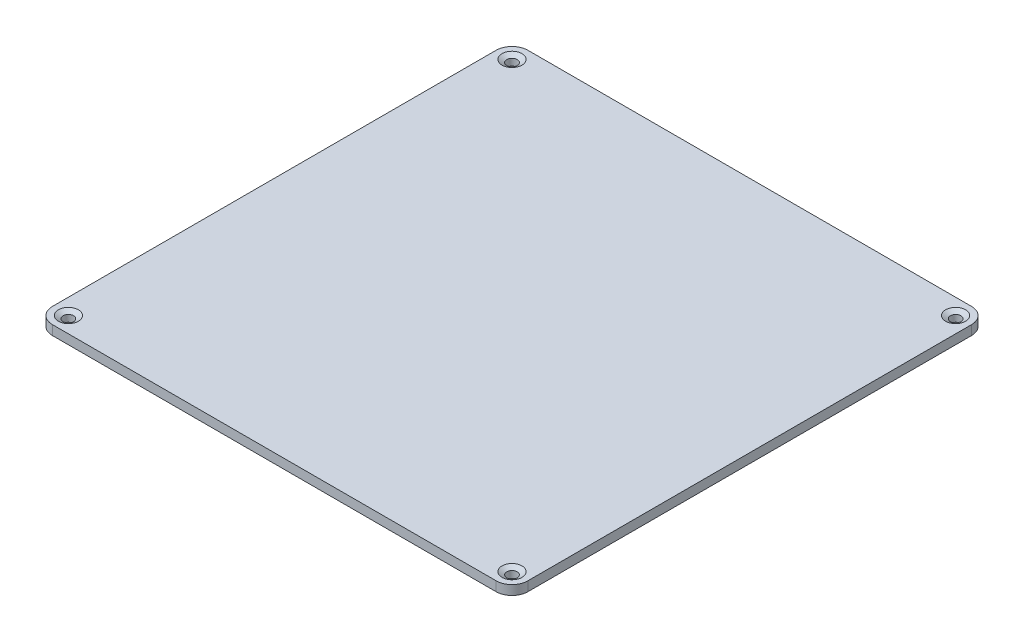
ISO-10303-21;
HEADER;
FILE_DESCRIPTION(('STEP AP214'),'2;1');
FILE_NAME('part.step','',(''),(''),'','','');
FILE_SCHEMA(('AUTOMOTIVE_DESIGN { 1 0 10303 214 1 1 1 1 }'));
ENDSEC;
DATA;
#1=APPLICATION_CONTEXT('core data for automotive mechanical design processes');
#2=APPLICATION_PROTOCOL_DEFINITION('international standard','automotive_design',2000,#1);
#3=PRODUCT_CONTEXT('',#1,'mechanical');
#4=PRODUCT('Part','Part','',(#3));
#5=PRODUCT_RELATED_PRODUCT_CATEGORY('part','',(#4));
#6=PRODUCT_DEFINITION_FORMATION('','',#4);
#7=PRODUCT_DEFINITION_CONTEXT('part definition',#1,'design');
#8=PRODUCT_DEFINITION('design','',#6,#7);
#9=PRODUCT_DEFINITION_SHAPE('','',#8);
#10=(LENGTH_UNIT() NAMED_UNIT(*) SI_UNIT(.MILLI.,.METRE.));
#11=(NAMED_UNIT(*) PLANE_ANGLE_UNIT() SI_UNIT($,.RADIAN.));
#12=(NAMED_UNIT(*) SI_UNIT($,.STERADIAN.) SOLID_ANGLE_UNIT());
#13=UNCERTAINTY_MEASURE_WITH_UNIT(LENGTH_MEASURE(1.E-05),#10,'distance_accuracy_value','');
#14=(GEOMETRIC_REPRESENTATION_CONTEXT(3) GLOBAL_UNCERTAINTY_ASSIGNED_CONTEXT((#13)) GLOBAL_UNIT_ASSIGNED_CONTEXT((#10,
#11,#12)) REPRESENTATION_CONTEXT('',''));
#15=CARTESIAN_POINT('',(0.,0.,0.));
#16=DIRECTION('',(0.,0.,1.));
#17=DIRECTION('',(1.,0.,0.));
#18=AXIS2_PLACEMENT_3D('',#15,#16,#17);
#19=CARTESIAN_POINT('',(75.,3.,75.));
#20=DIRECTION('',(-1.,0.,0.));
#21=DIRECTION('',(0.,0.,1.));
#22=AXIS2_PLACEMENT_3D('',#19,#20,#21);
#23=PLANE('',#22);
#24=DIRECTION('',(0.,0.,-1.));
#25=VECTOR('',#24,1.);
#26=CARTESIAN_POINT('',(75.,3.,75.));
#27=LINE('',#26,#25);
#28=CARTESIAN_POINT('',(75.,3.,70.));
#29=VERTEX_POINT('',#28);
#30=CARTESIAN_POINT('',(75.,3.,-70.));
#31=VERTEX_POINT('',#30);
#32=EDGE_CURVE('E127',#29,#31,#27,.T.);
#33=ORIENTED_EDGE('',*,*,#32,.F.);
#34=DIRECTION('',(0.,-1.,0.));
#35=VECTOR('',#34,1.);
#36=CARTESIAN_POINT('',(75.,3.,70.));
#37=LINE('',#36,#35);
#38=CARTESIAN_POINT('',(75.,0.,70.));
#39=VERTEX_POINT('',#38);
#40=EDGE_CURVE('E177',#29,#39,#37,.T.);
#41=ORIENTED_EDGE('',*,*,#40,.T.);
#42=DIRECTION('',(0.,0.,-1.));
#43=VECTOR('',#42,1.);
#44=CARTESIAN_POINT('',(75.,0.,75.));
#45=LINE('',#44,#43);
#46=CARTESIAN_POINT('',(75.,0.,-70.));
#47=VERTEX_POINT('',#46);
#48=EDGE_CURVE('E183',#39,#47,#45,.T.);
#49=ORIENTED_EDGE('',*,*,#48,.T.);
#50=DIRECTION('',(0.,-1.,0.));
#51=VECTOR('',#50,1.);
#52=CARTESIAN_POINT('',(75.,3.,-70.));
#53=LINE('',#52,#51);
#54=EDGE_CURVE('E175',#47,#31,#53,.F.);
#55=ORIENTED_EDGE('',*,*,#54,.T.);
#56=EDGE_LOOP('',(#33,#41,#49,#55));
#57=FACE_BOUND('',#56,.T.);
#58=ADVANCED_FACE('F35',(#57),#23,.F.);
#59=CARTESIAN_POINT('',(-75.,3.,-75.));
#60=DIRECTION('',(0.,0.,1.));
#61=DIRECTION('',(1.,0.,0.));
#62=AXIS2_PLACEMENT_3D('',#59,#60,#61);
#63=PLANE('',#62);
#64=DIRECTION('',(-1.,0.,0.));
#65=VECTOR('',#64,1.);
#66=CARTESIAN_POINT('',(-75.,3.,-75.));
#67=LINE('',#66,#65);
#68=CARTESIAN_POINT('',(70.,3.,-75.));
#69=VERTEX_POINT('',#68);
#70=CARTESIAN_POINT('',(-70.,3.,-75.));
#71=VERTEX_POINT('',#70);
#72=EDGE_CURVE('E130',#69,#71,#67,.T.);
#73=ORIENTED_EDGE('',*,*,#72,.F.);
#74=DIRECTION('',(0.,-1.,0.));
#75=VECTOR('',#74,1.);
#76=CARTESIAN_POINT('',(70.,3.,-75.));
#77=LINE('',#76,#75);
#78=CARTESIAN_POINT('',(70.,0.,-75.));
#79=VERTEX_POINT('',#78);
#80=EDGE_CURVE('E11',#69,#79,#77,.T.);
#81=ORIENTED_EDGE('',*,*,#80,.T.);
#82=DIRECTION('',(-1.,0.,0.));
#83=VECTOR('',#82,1.);
#84=CARTESIAN_POINT('',(-75.,0.,-75.));
#85=LINE('',#84,#83);
#86=CARTESIAN_POINT('',(-70.,0.,-75.));
#87=VERTEX_POINT('',#86);
#88=EDGE_CURVE('E132',#79,#87,#85,.T.);
#89=ORIENTED_EDGE('',*,*,#88,.T.);
#90=DIRECTION('',(0.,-1.,0.));
#91=VECTOR('',#90,1.);
#92=CARTESIAN_POINT('',(-70.,3.,-75.));
#93=LINE('',#92,#91);
#94=EDGE_CURVE('E43',#87,#71,#93,.F.);
#95=ORIENTED_EDGE('',*,*,#94,.T.);
#96=EDGE_LOOP('',(#73,#81,#89,#95));
#97=FACE_BOUND('',#96,.T.);
#98=ADVANCED_FACE('F226',(#97),#63,.F.);
#99=CARTESIAN_POINT('',(-75.,3.,75.));
#100=DIRECTION('',(1.,0.,0.));
#101=DIRECTION('',(0.,0.,-1.));
#102=AXIS2_PLACEMENT_3D('',#99,#100,#101);
#103=PLANE('',#102);
#104=DIRECTION('',(0.,0.,1.));
#105=VECTOR('',#104,1.);
#106=CARTESIAN_POINT('',(-75.,0.,75.));
#107=LINE('',#106,#105);
#108=CARTESIAN_POINT('',(-75.,0.,-70.));
#109=VERTEX_POINT('',#108);
#110=CARTESIAN_POINT('',(-75.,0.,70.));
#111=VERTEX_POINT('',#110);
#112=EDGE_CURVE('E128',#109,#111,#107,.T.);
#113=ORIENTED_EDGE('',*,*,#112,.T.);
#114=DIRECTION('',(0.,-1.,0.));
#115=VECTOR('',#114,1.);
#116=CARTESIAN_POINT('',(-75.,3.,70.));
#117=LINE('',#116,#115);
#118=CARTESIAN_POINT('',(-75.,3.,70.));
#119=VERTEX_POINT('',#118);
#120=EDGE_CURVE('E106',#111,#119,#117,.F.);
#121=ORIENTED_EDGE('',*,*,#120,.T.);
#122=DIRECTION('',(0.,0.,1.));
#123=VECTOR('',#122,1.);
#124=CARTESIAN_POINT('',(-75.,3.,75.));
#125=LINE('',#124,#123);
#126=CARTESIAN_POINT('',(-75.,3.,-70.));
#127=VERTEX_POINT('',#126);
#128=EDGE_CURVE('E195',#127,#119,#125,.T.);
#129=ORIENTED_EDGE('',*,*,#128,.F.);
#130=DIRECTION('',(0.,-1.,0.));
#131=VECTOR('',#130,1.);
#132=CARTESIAN_POINT('',(-75.,3.,-70.));
#133=LINE('',#132,#131);
#134=EDGE_CURVE('E111',#127,#109,#133,.T.);
#135=ORIENTED_EDGE('',*,*,#134,.T.);
#136=EDGE_LOOP('',(#113,#121,#129,#135));
#137=FACE_BOUND('',#136,.T.);
#138=ADVANCED_FACE('F231',(#137),#103,.F.);
#139=CARTESIAN_POINT('',(-75.,3.,75.));
#140=DIRECTION('',(0.,0.,-1.));
#141=DIRECTION('',(-1.,0.,0.));
#142=AXIS2_PLACEMENT_3D('',#139,#140,#141);
#143=PLANE('',#142);
#144=DIRECTION('',(1.,0.,0.));
#145=VECTOR('',#144,1.);
#146=CARTESIAN_POINT('',(-75.,3.,75.));
#147=LINE('',#146,#145);
#148=CARTESIAN_POINT('',(-70.,3.,75.));
#149=VERTEX_POINT('',#148);
#150=CARTESIAN_POINT('',(70.,3.,75.));
#151=VERTEX_POINT('',#150);
#152=EDGE_CURVE('E121',#149,#151,#147,.T.);
#153=ORIENTED_EDGE('',*,*,#152,.F.);
#154=DIRECTION('',(0.,-1.,0.));
#155=VECTOR('',#154,1.);
#156=CARTESIAN_POINT('',(-70.,3.,75.));
#157=LINE('',#156,#155);
#158=CARTESIAN_POINT('',(-70.,0.,75.));
#159=VERTEX_POINT('',#158);
#160=EDGE_CURVE('E105',#149,#159,#157,.T.);
#161=ORIENTED_EDGE('',*,*,#160,.T.);
#162=DIRECTION('',(1.,0.,0.));
#163=VECTOR('',#162,1.);
#164=CARTESIAN_POINT('',(-75.,0.,75.));
#165=LINE('',#164,#163);
#166=CARTESIAN_POINT('',(70.,0.,75.));
#167=VERTEX_POINT('',#166);
#168=EDGE_CURVE('E118',#159,#167,#165,.T.);
#169=ORIENTED_EDGE('',*,*,#168,.T.);
#170=DIRECTION('',(0.,-1.,0.));
#171=VECTOR('',#170,1.);
#172=CARTESIAN_POINT('',(70.,3.,75.));
#173=LINE('',#172,#171);
#174=EDGE_CURVE('E123',#167,#151,#173,.F.);
#175=ORIENTED_EDGE('',*,*,#174,.T.);
#176=EDGE_LOOP('',(#153,#161,#169,#175));
#177=FACE_BOUND('',#176,.T.);
#178=ADVANCED_FACE('F117',(#177),#143,.F.);
#179=CARTESIAN_POINT('',(0.,3.,0.));
#180=DIRECTION('',(0.,-1.,0.));
#181=DIRECTION('',(0.,0.,-1.));
#182=AXIS2_PLACEMENT_3D('',#179,#180,#181);
#183=PLANE('',#182);
#184=CARTESIAN_POINT('',(70.,3.,70.));
#185=DIRECTION('',(0.,-1.,0.));
#186=DIRECTION('',(0.,0.,-1.));
#187=AXIS2_PLACEMENT_3D('',#184,#185,#186);
#188=CIRCLE('',#187,3.1500000000001);
#189=CARTESIAN_POINT('',(70.,3.,66.8499999999999));
#190=VERTEX_POINT('',#189);
#191=EDGE_CURVE('E148',#190,#190,#188,.T.);
#192=ORIENTED_EDGE('',*,*,#191,.T.);
#193=EDGE_LOOP('',(#192));
#194=FACE_BOUND('',#193,.T.);
#195=CARTESIAN_POINT('',(-70.,3.,70.));
#196=DIRECTION('',(0.,-1.,0.));
#197=DIRECTION('',(0.,0.,-1.));
#198=AXIS2_PLACEMENT_3D('',#195,#196,#197);
#199=CIRCLE('',#198,3.1500000000001);
#200=CARTESIAN_POINT('',(-70.,3.,66.8499999999999));
#201=VERTEX_POINT('',#200);
#202=EDGE_CURVE('E145',#201,#201,#199,.T.);
#203=ORIENTED_EDGE('',*,*,#202,.T.);
#204=EDGE_LOOP('',(#203));
#205=FACE_BOUND('',#204,.T.);
#206=CARTESIAN_POINT('',(70.,3.,-70.));
#207=DIRECTION('',(0.,-1.,0.));
#208=DIRECTION('',(0.,0.,-1.));
#209=AXIS2_PLACEMENT_3D('',#206,#207,#208);
#210=CIRCLE('',#209,3.1500000000001);
#211=CARTESIAN_POINT('',(70.,3.,-73.1500000000001));
#212=VERTEX_POINT('',#211);
#213=EDGE_CURVE('E142',#212,#212,#210,.T.);
#214=ORIENTED_EDGE('',*,*,#213,.T.);
#215=EDGE_LOOP('',(#214));
#216=FACE_BOUND('',#215,.T.);
#217=CARTESIAN_POINT('',(-70.,3.,-70.));
#218=DIRECTION('',(0.,-1.,0.));
#219=DIRECTION('',(0.,0.,-1.));
#220=AXIS2_PLACEMENT_3D('',#217,#218,#219);
#221=CIRCLE('',#220,3.1500000000001);
#222=CARTESIAN_POINT('',(-70.,3.,-73.1500000000001));
#223=VERTEX_POINT('',#222);
#224=EDGE_CURVE('E139',#223,#223,#221,.T.);
#225=ORIENTED_EDGE('',*,*,#224,.T.);
#226=EDGE_LOOP('',(#225));
#227=FACE_BOUND('',#226,.T.);
#228=ORIENTED_EDGE('',*,*,#128,.T.);
#229=CARTESIAN_POINT('',(-70.,3.,70.));
#230=DIRECTION('',(0.,-1.,0.));
#231=DIRECTION('',(0.,0.,-1.));
#232=AXIS2_PLACEMENT_3D('',#229,#230,#231);
#233=CIRCLE('',#232,5.);
#234=EDGE_CURVE('E173',#119,#149,#233,.F.);
#235=ORIENTED_EDGE('',*,*,#234,.T.);
#236=ORIENTED_EDGE('',*,*,#152,.T.);
#237=CARTESIAN_POINT('',(70.,3.,70.));
#238=DIRECTION('',(0.,-1.,0.));
#239=DIRECTION('',(0.,0.,-1.));
#240=AXIS2_PLACEMENT_3D('',#237,#238,#239);
#241=CIRCLE('',#240,5.);
#242=EDGE_CURVE('E171',#151,#29,#241,.F.);
#243=ORIENTED_EDGE('',*,*,#242,.T.);
#244=ORIENTED_EDGE('',*,*,#32,.T.);
#245=CARTESIAN_POINT('',(70.,3.,-70.));
#246=DIRECTION('',(0.,-1.,0.));
#247=DIRECTION('',(0.,0.,-1.));
#248=AXIS2_PLACEMENT_3D('',#245,#246,#247);
#249=CIRCLE('',#248,5.);
#250=EDGE_CURVE('E56',#31,#69,#249,.F.);
#251=ORIENTED_EDGE('',*,*,#250,.T.);
#252=ORIENTED_EDGE('',*,*,#72,.T.);
#253=CARTESIAN_POINT('',(-70.,3.,-70.));
#254=DIRECTION('',(0.,-1.,0.));
#255=DIRECTION('',(0.,0.,-1.));
#256=AXIS2_PLACEMENT_3D('',#253,#254,#255);
#257=CIRCLE('',#256,5.);
#258=EDGE_CURVE('E168',#71,#127,#257,.F.);
#259=ORIENTED_EDGE('',*,*,#258,.T.);
#260=EDGE_LOOP('',(#228,#235,#236,#243,#244,#251,#252,#259));
#261=FACE_BOUND('',#260,.T.);
#262=ADVANCED_FACE('F279',(#194,#205,#216,#227,#261),#183,.F.);
#263=CARTESIAN_POINT('',(0.,0.,0.));
#264=DIRECTION('',(0.,-1.,0.));
#265=DIRECTION('',(0.,0.,-1.));
#266=AXIS2_PLACEMENT_3D('',#263,#264,#265);
#267=PLANE('',#266);
#268=CARTESIAN_POINT('',(-70.,0.,70.));
#269=DIRECTION('',(0.,-1.,0.));
#270=DIRECTION('',(0.,0.,-1.));
#271=AXIS2_PLACEMENT_3D('',#268,#269,#270);
#272=CIRCLE('',#271,1.65);
#273=CARTESIAN_POINT('',(-70.,0.,68.35));
#274=VERTEX_POINT('',#273);
#275=EDGE_CURVE('E199',#274,#274,#272,.F.);
#276=ORIENTED_EDGE('',*,*,#275,.T.);
#277=EDGE_LOOP('',(#276));
#278=FACE_BOUND('',#277,.T.);
#279=CARTESIAN_POINT('',(70.,0.,70.));
#280=DIRECTION('',(0.,-1.,0.));
#281=DIRECTION('',(0.,0.,-1.));
#282=AXIS2_PLACEMENT_3D('',#279,#280,#281);
#283=CIRCLE('',#282,1.65);
#284=CARTESIAN_POINT('',(70.,0.,68.35));
#285=VERTEX_POINT('',#284);
#286=EDGE_CURVE('E202',#285,#285,#283,.F.);
#287=ORIENTED_EDGE('',*,*,#286,.T.);
#288=EDGE_LOOP('',(#287));
#289=FACE_BOUND('',#288,.T.);
#290=CARTESIAN_POINT('',(70.,0.,-70.));
#291=DIRECTION('',(0.,-1.,0.));
#292=DIRECTION('',(0.,0.,-1.));
#293=AXIS2_PLACEMENT_3D('',#290,#291,#292);
#294=CIRCLE('',#293,1.65);
#295=CARTESIAN_POINT('',(70.,0.,-71.65));
#296=VERTEX_POINT('',#295);
#297=EDGE_CURVE('E191',#296,#296,#294,.F.);
#298=ORIENTED_EDGE('',*,*,#297,.T.);
#299=EDGE_LOOP('',(#298));
#300=FACE_BOUND('',#299,.T.);
#301=CARTESIAN_POINT('',(-70.,0.,-70.));
#302=DIRECTION('',(0.,-1.,0.));
#303=DIRECTION('',(0.,0.,-1.));
#304=AXIS2_PLACEMENT_3D('',#301,#302,#303);
#305=CIRCLE('',#304,1.65);
#306=CARTESIAN_POINT('',(-70.,0.,-71.65));
#307=VERTEX_POINT('',#306);
#308=EDGE_CURVE('E188',#307,#307,#305,.F.);
#309=ORIENTED_EDGE('',*,*,#308,.T.);
#310=EDGE_LOOP('',(#309));
#311=FACE_BOUND('',#310,.T.);
#312=ORIENTED_EDGE('',*,*,#168,.F.);
#313=CARTESIAN_POINT('',(-70.,0.,70.));
#314=DIRECTION('',(0.,-1.,0.));
#315=DIRECTION('',(0.,0.,-1.));
#316=AXIS2_PLACEMENT_3D('',#313,#314,#315);
#317=CIRCLE('',#316,5.);
#318=EDGE_CURVE('E101',#159,#111,#317,.T.);
#319=ORIENTED_EDGE('',*,*,#318,.T.);
#320=ORIENTED_EDGE('',*,*,#112,.F.);
#321=CARTESIAN_POINT('',(-70.,0.,-70.));
#322=DIRECTION('',(0.,-1.,0.));
#323=DIRECTION('',(0.,0.,-1.));
#324=AXIS2_PLACEMENT_3D('',#321,#322,#323);
#325=CIRCLE('',#324,5.);
#326=EDGE_CURVE('E122',#109,#87,#325,.T.);
#327=ORIENTED_EDGE('',*,*,#326,.T.);
#328=ORIENTED_EDGE('',*,*,#88,.F.);
#329=CARTESIAN_POINT('',(70.,0.,-70.));
#330=DIRECTION('',(0.,-1.,0.));
#331=DIRECTION('',(0.,0.,-1.));
#332=AXIS2_PLACEMENT_3D('',#329,#330,#331);
#333=CIRCLE('',#332,5.);
#334=EDGE_CURVE('E162',#79,#47,#333,.T.);
#335=ORIENTED_EDGE('',*,*,#334,.T.);
#336=ORIENTED_EDGE('',*,*,#48,.F.);
#337=CARTESIAN_POINT('',(70.,0.,70.));
#338=DIRECTION('',(0.,-1.,0.));
#339=DIRECTION('',(0.,0.,-1.));
#340=AXIS2_PLACEMENT_3D('',#337,#338,#339);
#341=CIRCLE('',#340,5.);
#342=EDGE_CURVE('E112',#39,#167,#341,.T.);
#343=ORIENTED_EDGE('',*,*,#342,.T.);
#344=EDGE_LOOP('',(#312,#319,#320,#327,#328,#335,#336,#343));
#345=FACE_BOUND('',#344,.T.);
#346=ADVANCED_FACE('F125',(#278,#289,#300,#311,#345),#267,.T.);
#347=CARTESIAN_POINT('',(-70.,-0.00100000000000013,-70.));
#348=DIRECTION('',(0.,1.,0.));
#349=DIRECTION('',(0.,0.,1.));
#350=AXIS2_PLACEMENT_3D('',#347,#348,#349);
#351=CYLINDRICAL_SURFACE('',#350,1.65);
#352=CARTESIAN_POINT('',(-70.,2.13397459621551,-70.));
#353=DIRECTION('',(0.,-1.,0.));
#354=DIRECTION('',(0.,0.,-1.));
#355=AXIS2_PLACEMENT_3D('',#352,#353,#354);
#356=CIRCLE('',#355,1.65);
#357=CARTESIAN_POINT('',(-70.,2.13397459621551,-71.65));
#358=VERTEX_POINT('',#357);
#359=EDGE_CURVE('E157',#358,#358,#356,.F.);
#360=ORIENTED_EDGE('',*,*,#359,.T.);
#361=EDGE_LOOP('',(#360));
#362=FACE_BOUND('',#361,.T.);
#363=ORIENTED_EDGE('',*,*,#308,.F.);
#364=EDGE_LOOP('',(#363));
#365=FACE_BOUND('',#364,.T.);
#366=ADVANCED_FACE('F213',(#362,#365),#351,.F.);
#367=CARTESIAN_POINT('',(70.,-0.00100000000000013,-70.));
#368=DIRECTION('',(0.,1.,0.));
#369=DIRECTION('',(0.,0.,1.));
#370=AXIS2_PLACEMENT_3D('',#367,#368,#369);
#371=CYLINDRICAL_SURFACE('',#370,1.65);
#372=CARTESIAN_POINT('',(70.,2.13397459621551,-70.));
#373=DIRECTION('',(0.,-1.,0.));
#374=DIRECTION('',(0.,0.,-1.));
#375=AXIS2_PLACEMENT_3D('',#372,#373,#374);
#376=CIRCLE('',#375,1.65);
#377=CARTESIAN_POINT('',(70.,2.13397459621551,-71.65));
#378=VERTEX_POINT('',#377);
#379=EDGE_CURVE('E154',#378,#378,#376,.F.);
#380=ORIENTED_EDGE('',*,*,#379,.T.);
#381=EDGE_LOOP('',(#380));
#382=FACE_BOUND('',#381,.T.);
#383=ORIENTED_EDGE('',*,*,#297,.F.);
#384=EDGE_LOOP('',(#383));
#385=FACE_BOUND('',#384,.T.);
#386=ADVANCED_FACE('F210',(#382,#385),#371,.F.);
#387=CARTESIAN_POINT('',(70.,-0.00100000000000013,70.));
#388=DIRECTION('',(0.,1.,0.));
#389=DIRECTION('',(0.,0.,1.));
#390=AXIS2_PLACEMENT_3D('',#387,#388,#389);
#391=CYLINDRICAL_SURFACE('',#390,1.65);
#392=CARTESIAN_POINT('',(70.,2.13397459621551,70.));
#393=DIRECTION('',(0.,-1.,0.));
#394=DIRECTION('',(0.,0.,-1.));
#395=AXIS2_PLACEMENT_3D('',#392,#393,#394);
#396=CIRCLE('',#395,1.65);
#397=CARTESIAN_POINT('',(70.,2.13397459621551,68.35));
#398=VERTEX_POINT('',#397);
#399=EDGE_CURVE('E136',#398,#398,#396,.F.);
#400=ORIENTED_EDGE('',*,*,#399,.T.);
#401=EDGE_LOOP('',(#400));
#402=FACE_BOUND('',#401,.T.);
#403=ORIENTED_EDGE('',*,*,#286,.F.);
#404=EDGE_LOOP('',(#403));
#405=FACE_BOUND('',#404,.T.);
#406=ADVANCED_FACE('F212',(#402,#405),#391,.F.);
#407=CARTESIAN_POINT('',(-70.,-0.00100000000000013,70.));
#408=DIRECTION('',(0.,1.,0.));
#409=DIRECTION('',(0.,0.,1.));
#410=AXIS2_PLACEMENT_3D('',#407,#408,#409);
#411=CYLINDRICAL_SURFACE('',#410,1.65);
#412=CARTESIAN_POINT('',(-70.,2.13397459621551,70.));
#413=DIRECTION('',(0.,-1.,0.));
#414=DIRECTION('',(0.,0.,-1.));
#415=AXIS2_PLACEMENT_3D('',#412,#413,#414);
#416=CIRCLE('',#415,1.65);
#417=CARTESIAN_POINT('',(-70.,2.13397459621551,68.35));
#418=VERTEX_POINT('',#417);
#419=EDGE_CURVE('E151',#418,#418,#416,.F.);
#420=ORIENTED_EDGE('',*,*,#419,.T.);
#421=EDGE_LOOP('',(#420));
#422=FACE_BOUND('',#421,.T.);
#423=ORIENTED_EDGE('',*,*,#275,.F.);
#424=EDGE_LOOP('',(#423));
#425=FACE_BOUND('',#424,.T.);
#426=ADVANCED_FACE('F220',(#422,#425),#411,.F.);
#427=CARTESIAN_POINT('',(70.,2.13397459621551,70.));
#428=DIRECTION('',(0.,1.,0.));
#429=DIRECTION('',(0.,0.,1.));
#430=AXIS2_PLACEMENT_3D('',#427,#428,#429);
#431=CONICAL_SURFACE('',#430,1.65,1.0471975511966);
#432=ORIENTED_EDGE('',*,*,#191,.F.);
#433=EDGE_LOOP('',(#432));
#434=FACE_BOUND('',#433,.T.);
#435=ORIENTED_EDGE('',*,*,#399,.F.);
#436=EDGE_LOOP('',(#435));
#437=FACE_BOUND('',#436,.T.);
#438=ADVANCED_FACE('F236',(#434,#437),#431,.F.);
#439=CARTESIAN_POINT('',(-70.,2.13397459621551,70.));
#440=DIRECTION('',(0.,1.,0.));
#441=DIRECTION('',(0.,0.,1.));
#442=AXIS2_PLACEMENT_3D('',#439,#440,#441);
#443=CONICAL_SURFACE('',#442,1.65,1.0471975511966);
#444=ORIENTED_EDGE('',*,*,#202,.F.);
#445=EDGE_LOOP('',(#444));
#446=FACE_BOUND('',#445,.T.);
#447=ORIENTED_EDGE('',*,*,#419,.F.);
#448=EDGE_LOOP('',(#447));
#449=FACE_BOUND('',#448,.T.);
#450=ADVANCED_FACE('F242',(#446,#449),#443,.F.);
#451=CARTESIAN_POINT('',(70.,2.13397459621551,-70.));
#452=DIRECTION('',(0.,1.,0.));
#453=DIRECTION('',(0.,0.,1.));
#454=AXIS2_PLACEMENT_3D('',#451,#452,#453);
#455=CONICAL_SURFACE('',#454,1.65,1.0471975511966);
#456=ORIENTED_EDGE('',*,*,#213,.F.);
#457=EDGE_LOOP('',(#456));
#458=FACE_BOUND('',#457,.T.);
#459=ORIENTED_EDGE('',*,*,#379,.F.);
#460=EDGE_LOOP('',(#459));
#461=FACE_BOUND('',#460,.T.);
#462=ADVANCED_FACE('F249',(#458,#461),#455,.F.);
#463=CARTESIAN_POINT('',(-70.,2.13397459621551,-70.));
#464=DIRECTION('',(0.,1.,0.));
#465=DIRECTION('',(0.,0.,1.));
#466=AXIS2_PLACEMENT_3D('',#463,#464,#465);
#467=CONICAL_SURFACE('',#466,1.65,1.0471975511966);
#468=ORIENTED_EDGE('',*,*,#224,.F.);
#469=EDGE_LOOP('',(#468));
#470=FACE_BOUND('',#469,.T.);
#471=ORIENTED_EDGE('',*,*,#359,.F.);
#472=EDGE_LOOP('',(#471));
#473=FACE_BOUND('',#472,.T.);
#474=ADVANCED_FACE('F256',(#470,#473),#467,.F.);
#475=CARTESIAN_POINT('',(-70.,3.,70.));
#476=DIRECTION('',(0.,-1.,0.));
#477=DIRECTION('',(0.,0.,-1.));
#478=AXIS2_PLACEMENT_3D('',#475,#476,#477);
#479=CYLINDRICAL_SURFACE('',#478,5.);
#480=ORIENTED_EDGE('',*,*,#234,.F.);
#481=ORIENTED_EDGE('',*,*,#120,.F.);
#482=ORIENTED_EDGE('',*,*,#318,.F.);
#483=ORIENTED_EDGE('',*,*,#160,.F.);
#484=EDGE_LOOP('',(#480,#481,#482,#483));
#485=FACE_BOUND('',#484,.T.);
#486=ADVANCED_FACE('F104',(#485),#479,.T.);
#487=CARTESIAN_POINT('',(70.,3.,70.));
#488=DIRECTION('',(0.,-1.,0.));
#489=DIRECTION('',(0.,0.,-1.));
#490=AXIS2_PLACEMENT_3D('',#487,#488,#489);
#491=CYLINDRICAL_SURFACE('',#490,5.);
#492=ORIENTED_EDGE('',*,*,#242,.F.);
#493=ORIENTED_EDGE('',*,*,#174,.F.);
#494=ORIENTED_EDGE('',*,*,#342,.F.);
#495=ORIENTED_EDGE('',*,*,#40,.F.);
#496=EDGE_LOOP('',(#492,#493,#494,#495));
#497=FACE_BOUND('',#496,.T.);
#498=ADVANCED_FACE('F265',(#497),#491,.T.);
#499=CARTESIAN_POINT('',(70.,3.,-70.));
#500=DIRECTION('',(0.,-1.,0.));
#501=DIRECTION('',(0.,0.,-1.));
#502=AXIS2_PLACEMENT_3D('',#499,#500,#501);
#503=CYLINDRICAL_SURFACE('',#502,5.);
#504=ORIENTED_EDGE('',*,*,#250,.F.);
#505=ORIENTED_EDGE('',*,*,#54,.F.);
#506=ORIENTED_EDGE('',*,*,#334,.F.);
#507=ORIENTED_EDGE('',*,*,#80,.F.);
#508=EDGE_LOOP('',(#504,#505,#506,#507));
#509=FACE_BOUND('',#508,.T.);
#510=ADVANCED_FACE('F267',(#509),#503,.T.);
#511=CARTESIAN_POINT('',(-70.,3.,-70.));
#512=DIRECTION('',(0.,-1.,0.));
#513=DIRECTION('',(0.,0.,-1.));
#514=AXIS2_PLACEMENT_3D('',#511,#512,#513);
#515=CYLINDRICAL_SURFACE('',#514,5.);
#516=ORIENTED_EDGE('',*,*,#258,.F.);
#517=ORIENTED_EDGE('',*,*,#94,.F.);
#518=ORIENTED_EDGE('',*,*,#326,.F.);
#519=ORIENTED_EDGE('',*,*,#134,.F.);
#520=EDGE_LOOP('',(#516,#517,#518,#519));
#521=FACE_BOUND('',#520,.T.);
#522=ADVANCED_FACE('F37',(#521),#515,.T.);
#523=CLOSED_SHELL('',(#58,#98,#138,#178,#262,#346,#366,#386,#406,#426,#438,#450,#462,#474,#486,
#498,#510,#522));
#524=MANIFOLD_SOLID_BREP('B2',#523);
#525=ADVANCED_BREP_SHAPE_REPRESENTATION('',(#18,#524),#14);
#526=SHAPE_DEFINITION_REPRESENTATION(#9,#525);
ENDSEC;
END-ISO-10303-21;
